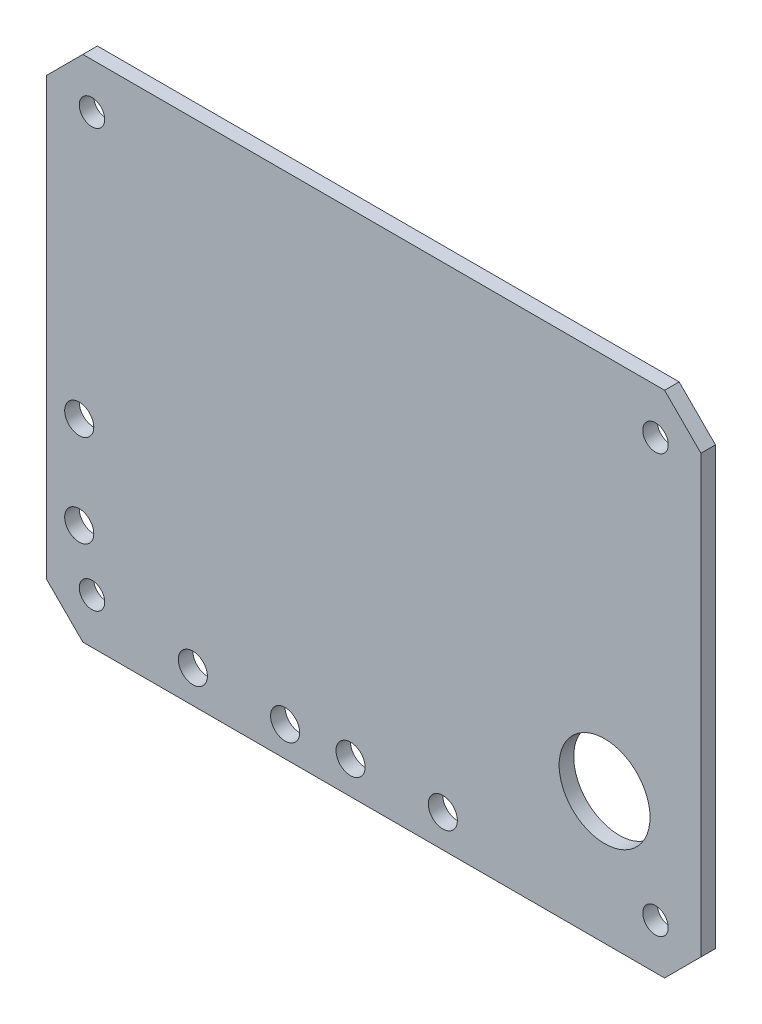
ISO-10303-21;
HEADER;
FILE_DESCRIPTION(('STEP AP214'),'2;1');
FILE_NAME('part.step','',(''),(''),'','','');
FILE_SCHEMA(('AUTOMOTIVE_DESIGN { 1 0 10303 214 1 1 1 1 }'));
ENDSEC;
DATA;
#1=APPLICATION_CONTEXT('core data for automotive mechanical design processes');
#2=APPLICATION_PROTOCOL_DEFINITION('international standard','automotive_design',2000,#1);
#3=PRODUCT_CONTEXT('',#1,'mechanical');
#4=PRODUCT('Part','Part','',(#3));
#5=PRODUCT_RELATED_PRODUCT_CATEGORY('part','',(#4));
#6=PRODUCT_DEFINITION_FORMATION('','',#4);
#7=PRODUCT_DEFINITION_CONTEXT('part definition',#1,'design');
#8=PRODUCT_DEFINITION('design','',#6,#7);
#9=PRODUCT_DEFINITION_SHAPE('','',#8);
#10=(LENGTH_UNIT() NAMED_UNIT(*) SI_UNIT(.MILLI.,.METRE.));
#11=(NAMED_UNIT(*) PLANE_ANGLE_UNIT() SI_UNIT($,.RADIAN.));
#12=(NAMED_UNIT(*) SI_UNIT($,.STERADIAN.) SOLID_ANGLE_UNIT());
#13=UNCERTAINTY_MEASURE_WITH_UNIT(LENGTH_MEASURE(1.E-05),#10,'distance_accuracy_value','');
#14=(GEOMETRIC_REPRESENTATION_CONTEXT(3) GLOBAL_UNCERTAINTY_ASSIGNED_CONTEXT((#13)) GLOBAL_UNIT_ASSIGNED_CONTEXT((#10,
#11,#12)) REPRESENTATION_CONTEXT('',''));
#15=CARTESIAN_POINT('',(0.,0.,0.));
#16=DIRECTION('',(0.,0.,1.));
#17=DIRECTION('',(1.,0.,0.));
#18=AXIS2_PLACEMENT_3D('',#15,#16,#17);
#19=CARTESIAN_POINT('',(32.,28.,1.6));
#20=DIRECTION('',(0.,-1.,0.));
#21=DIRECTION('',(1.,0.,0.));
#22=AXIS2_PLACEMENT_3D('',#19,#20,#21);
#23=PLANE('',#22);
#24=DIRECTION('',(-1.,0.,0.));
#25=VECTOR('',#24,1.);
#26=CARTESIAN_POINT('',(32.,28.,0.));
#27=LINE('',#26,#25);
#28=CARTESIAN_POINT('',(32.,28.,0.));
#29=VERTEX_POINT('',#28);
#30=CARTESIAN_POINT('',(-32.,28.,0.));
#31=VERTEX_POINT('',#30);
#32=EDGE_CURVE('E131',#29,#31,#27,.T.);
#33=ORIENTED_EDGE('',*,*,#32,.T.);
#34=DIRECTION('',(0.,0.,-1.));
#35=VECTOR('',#34,1.);
#36=CARTESIAN_POINT('',(-32.,28.,1.6));
#37=LINE('',#36,#35);
#38=CARTESIAN_POINT('',(-32.,28.,1.6));
#39=VERTEX_POINT('',#38);
#40=EDGE_CURVE('E11',#39,#31,#37,.T.);
#41=ORIENTED_EDGE('',*,*,#40,.F.);
#42=DIRECTION('',(-1.,0.,0.));
#43=VECTOR('',#42,1.);
#44=CARTESIAN_POINT('',(32.,28.,1.6));
#45=LINE('',#44,#43);
#46=CARTESIAN_POINT('',(32.,28.,1.6));
#47=VERTEX_POINT('',#46);
#48=EDGE_CURVE('E146',#47,#39,#45,.T.);
#49=ORIENTED_EDGE('',*,*,#48,.F.);
#50=DIRECTION('',(0.,0.,-1.));
#51=VECTOR('',#50,1.);
#52=CARTESIAN_POINT('',(32.,28.,1.6));
#53=LINE('',#52,#51);
#54=EDGE_CURVE('E127',#47,#29,#53,.T.);
#55=ORIENTED_EDGE('',*,*,#54,.T.);
#56=EDGE_LOOP('',(#33,#41,#49,#55));
#57=FACE_BOUND('',#56,.T.);
#58=ADVANCED_FACE('F33',(#57),#23,.F.);
#59=CARTESIAN_POINT('',(-36.,24.,1.6));
#60=DIRECTION('',(0.707106781186548,-0.707106781186547,0.));
#61=DIRECTION('',(0.707106781186547,0.707106781186548,0.));
#62=AXIS2_PLACEMENT_3D('',#59,#60,#61);
#63=PLANE('',#62);
#64=DIRECTION('',(-0.707106781186547,-0.707106781186548,0.));
#65=VECTOR('',#64,1.);
#66=CARTESIAN_POINT('',(-36.,24.,0.));
#67=LINE('',#66,#65);
#68=CARTESIAN_POINT('',(-36.,24.,0.));
#69=VERTEX_POINT('',#68);
#70=EDGE_CURVE('E134',#31,#69,#67,.T.);
#71=ORIENTED_EDGE('',*,*,#70,.T.);
#72=DIRECTION('',(0.,0.,-1.));
#73=VECTOR('',#72,1.);
#74=CARTESIAN_POINT('',(-36.,24.,1.6));
#75=LINE('',#74,#73);
#76=CARTESIAN_POINT('',(-36.,24.,1.6));
#77=VERTEX_POINT('',#76);
#78=EDGE_CURVE('E42',#77,#69,#75,.T.);
#79=ORIENTED_EDGE('',*,*,#78,.F.);
#80=DIRECTION('',(-0.707106781186547,-0.707106781186548,0.));
#81=VECTOR('',#80,1.);
#82=CARTESIAN_POINT('',(-36.,24.,1.6));
#83=LINE('',#82,#81);
#84=EDGE_CURVE('E94',#39,#77,#83,.T.);
#85=ORIENTED_EDGE('',*,*,#84,.F.);
#86=ORIENTED_EDGE('',*,*,#40,.T.);
#87=EDGE_LOOP('',(#71,#79,#85,#86));
#88=FACE_BOUND('',#87,.T.);
#89=ADVANCED_FACE('F245',(#88),#63,.F.);
#90=CARTESIAN_POINT('',(-36.,-24.,1.6));
#91=DIRECTION('',(1.,0.,0.));
#92=DIRECTION('',(0.,0.,-1.));
#93=AXIS2_PLACEMENT_3D('',#90,#91,#92);
#94=PLANE('',#93);
#95=DIRECTION('',(0.,-1.,0.));
#96=VECTOR('',#95,1.);
#97=CARTESIAN_POINT('',(-36.,-24.,0.));
#98=LINE('',#97,#96);
#99=CARTESIAN_POINT('',(-36.,-24.,0.));
#100=VERTEX_POINT('',#99);
#101=EDGE_CURVE('E137',#69,#100,#98,.T.);
#102=ORIENTED_EDGE('',*,*,#101,.T.);
#103=DIRECTION('',(0.,0.,-1.));
#104=VECTOR('',#103,1.);
#105=CARTESIAN_POINT('',(-36.,-24.,1.6));
#106=LINE('',#105,#104);
#107=CARTESIAN_POINT('',(-36.,-24.,1.6));
#108=VERTEX_POINT('',#107);
#109=EDGE_CURVE('E153',#108,#100,#106,.T.);
#110=ORIENTED_EDGE('',*,*,#109,.F.);
#111=DIRECTION('',(0.,-1.,0.));
#112=VECTOR('',#111,1.);
#113=CARTESIAN_POINT('',(-36.,-24.,1.6));
#114=LINE('',#113,#112);
#115=EDGE_CURVE('E212',#77,#108,#114,.T.);
#116=ORIENTED_EDGE('',*,*,#115,.F.);
#117=ORIENTED_EDGE('',*,*,#78,.T.);
#118=EDGE_LOOP('',(#102,#110,#116,#117));
#119=FACE_BOUND('',#118,.T.);
#120=ADVANCED_FACE('F249',(#119),#94,.F.);
#121=CARTESIAN_POINT('',(-36.,-24.,1.6));
#122=DIRECTION('',(0.707106781186548,0.707106781186547,0.));
#123=DIRECTION('',(-0.707106781186547,0.707106781186548,0.));
#124=AXIS2_PLACEMENT_3D('',#121,#122,#123);
#125=PLANE('',#124);
#126=DIRECTION('',(0.707106781186547,-0.707106781186548,0.));
#127=VECTOR('',#126,1.);
#128=CARTESIAN_POINT('',(-36.,-24.,0.));
#129=LINE('',#128,#127);
#130=CARTESIAN_POINT('',(-32.,-28.,0.));
#131=VERTEX_POINT('',#130);
#132=EDGE_CURVE('E139',#100,#131,#129,.T.);
#133=ORIENTED_EDGE('',*,*,#132,.T.);
#134=DIRECTION('',(0.,0.,-1.));
#135=VECTOR('',#134,1.);
#136=CARTESIAN_POINT('',(-32.,-28.,1.6));
#137=LINE('',#136,#135);
#138=CARTESIAN_POINT('',(-32.,-28.,1.6));
#139=VERTEX_POINT('',#138);
#140=EDGE_CURVE('E150',#139,#131,#137,.T.);
#141=ORIENTED_EDGE('',*,*,#140,.F.);
#142=DIRECTION('',(0.707106781186547,-0.707106781186548,0.));
#143=VECTOR('',#142,1.);
#144=CARTESIAN_POINT('',(-36.,-24.,1.6));
#145=LINE('',#144,#143);
#146=EDGE_CURVE('E214',#108,#139,#145,.T.);
#147=ORIENTED_EDGE('',*,*,#146,.F.);
#148=ORIENTED_EDGE('',*,*,#109,.T.);
#149=EDGE_LOOP('',(#133,#141,#147,#148));
#150=FACE_BOUND('',#149,.T.);
#151=ADVANCED_FACE('F220',(#150),#125,.F.);
#152=CARTESIAN_POINT('',(32.,-28.,1.6));
#153=DIRECTION('',(0.,1.,0.));
#154=DIRECTION('',(-1.,0.,0.));
#155=AXIS2_PLACEMENT_3D('',#152,#153,#154);
#156=PLANE('',#155);
#157=DIRECTION('',(1.,0.,0.));
#158=VECTOR('',#157,1.);
#159=CARTESIAN_POINT('',(32.,-28.,0.));
#160=LINE('',#159,#158);
#161=CARTESIAN_POINT('',(32.,-28.,0.));
#162=VERTEX_POINT('',#161);
#163=EDGE_CURVE('E141',#131,#162,#160,.T.);
#164=ORIENTED_EDGE('',*,*,#163,.T.);
#165=DIRECTION('',(0.,0.,-1.));
#166=VECTOR('',#165,1.);
#167=CARTESIAN_POINT('',(32.,-28.,1.6));
#168=LINE('',#167,#166);
#169=CARTESIAN_POINT('',(32.,-28.,1.6));
#170=VERTEX_POINT('',#169);
#171=EDGE_CURVE('E122',#170,#162,#168,.T.);
#172=ORIENTED_EDGE('',*,*,#171,.F.);
#173=DIRECTION('',(1.,0.,0.));
#174=VECTOR('',#173,1.);
#175=CARTESIAN_POINT('',(32.,-28.,1.6));
#176=LINE('',#175,#174);
#177=EDGE_CURVE('E113',#139,#170,#176,.T.);
#178=ORIENTED_EDGE('',*,*,#177,.F.);
#179=ORIENTED_EDGE('',*,*,#140,.T.);
#180=EDGE_LOOP('',(#164,#172,#178,#179));
#181=FACE_BOUND('',#180,.T.);
#182=ADVANCED_FACE('F224',(#181),#156,.F.);
#183=CARTESIAN_POINT('',(32.,-28.,1.6));
#184=DIRECTION('',(-0.707106781186548,0.707106781186547,0.));
#185=DIRECTION('',(-0.707106781186547,-0.707106781186548,0.));
#186=AXIS2_PLACEMENT_3D('',#183,#184,#185);
#187=PLANE('',#186);
#188=DIRECTION('',(0.707106781186547,0.707106781186548,0.));
#189=VECTOR('',#188,1.);
#190=CARTESIAN_POINT('',(32.,-28.,0.));
#191=LINE('',#190,#189);
#192=CARTESIAN_POINT('',(36.,-24.,0.));
#193=VERTEX_POINT('',#192);
#194=EDGE_CURVE('E121',#162,#193,#191,.T.);
#195=ORIENTED_EDGE('',*,*,#194,.T.);
#196=DIRECTION('',(0.,0.,-1.));
#197=VECTOR('',#196,1.);
#198=CARTESIAN_POINT('',(36.,-24.,1.6));
#199=LINE('',#198,#197);
#200=CARTESIAN_POINT('',(36.,-24.,1.6));
#201=VERTEX_POINT('',#200);
#202=EDGE_CURVE('E118',#201,#193,#199,.T.);
#203=ORIENTED_EDGE('',*,*,#202,.F.);
#204=DIRECTION('',(0.707106781186547,0.707106781186548,0.));
#205=VECTOR('',#204,1.);
#206=CARTESIAN_POINT('',(32.,-28.,1.6));
#207=LINE('',#206,#205);
#208=EDGE_CURVE('E107',#170,#201,#207,.T.);
#209=ORIENTED_EDGE('',*,*,#208,.F.);
#210=ORIENTED_EDGE('',*,*,#171,.T.);
#211=EDGE_LOOP('',(#195,#203,#209,#210));
#212=FACE_BOUND('',#211,.T.);
#213=ADVANCED_FACE('F119',(#212),#187,.F.);
#214=CARTESIAN_POINT('',(36.,-24.,1.6));
#215=DIRECTION('',(-1.,0.,0.));
#216=DIRECTION('',(0.,0.,1.));
#217=AXIS2_PLACEMENT_3D('',#214,#215,#216);
#218=PLANE('',#217);
#219=DIRECTION('',(0.,1.,0.));
#220=VECTOR('',#219,1.);
#221=CARTESIAN_POINT('',(36.,-24.,0.));
#222=LINE('',#221,#220);
#223=CARTESIAN_POINT('',(36.,24.,0.));
#224=VERTEX_POINT('',#223);
#225=EDGE_CURVE('E80',#193,#224,#222,.T.);
#226=ORIENTED_EDGE('',*,*,#225,.T.);
#227=DIRECTION('',(0.,0.,-1.));
#228=VECTOR('',#227,1.);
#229=CARTESIAN_POINT('',(36.,24.,1.6));
#230=LINE('',#229,#228);
#231=CARTESIAN_POINT('',(36.,24.,1.6));
#232=VERTEX_POINT('',#231);
#233=EDGE_CURVE('E123',#232,#224,#230,.T.);
#234=ORIENTED_EDGE('',*,*,#233,.F.);
#235=DIRECTION('',(0.,1.,0.));
#236=VECTOR('',#235,1.);
#237=CARTESIAN_POINT('',(36.,-24.,1.6));
#238=LINE('',#237,#236);
#239=EDGE_CURVE('E111',#201,#232,#238,.T.);
#240=ORIENTED_EDGE('',*,*,#239,.F.);
#241=ORIENTED_EDGE('',*,*,#202,.T.);
#242=EDGE_LOOP('',(#226,#234,#240,#241));
#243=FACE_BOUND('',#242,.T.);
#244=ADVANCED_FACE('F125',(#243),#218,.F.);
#245=CARTESIAN_POINT('',(32.,28.,1.6));
#246=DIRECTION('',(-0.707106781186548,-0.707106781186548,0.));
#247=DIRECTION('',(0.707106781186548,-0.707106781186548,0.));
#248=AXIS2_PLACEMENT_3D('',#245,#246,#247);
#249=PLANE('',#248);
#250=DIRECTION('',(-0.707106781186548,0.707106781186548,0.));
#251=VECTOR('',#250,1.);
#252=CARTESIAN_POINT('',(32.,28.,0.));
#253=LINE('',#252,#251);
#254=EDGE_CURVE('E86',#224,#29,#253,.T.);
#255=ORIENTED_EDGE('',*,*,#254,.T.);
#256=ORIENTED_EDGE('',*,*,#54,.F.);
#257=DIRECTION('',(-0.707106781186548,0.707106781186548,0.));
#258=VECTOR('',#257,1.);
#259=CARTESIAN_POINT('',(32.,28.,1.6));
#260=LINE('',#259,#258);
#261=EDGE_CURVE('E51',#232,#47,#260,.T.);
#262=ORIENTED_EDGE('',*,*,#261,.F.);
#263=ORIENTED_EDGE('',*,*,#233,.T.);
#264=EDGE_LOOP('',(#255,#256,#262,#263));
#265=FACE_BOUND('',#264,.T.);
#266=ADVANCED_FACE('F232',(#265),#249,.F.);
#267=CARTESIAN_POINT('',(0.,0.,1.6));
#268=DIRECTION('',(0.,0.,-1.));
#269=DIRECTION('',(-1.,0.,0.));
#270=AXIS2_PLACEMENT_3D('',#267,#268,#269);
#271=PLANE('',#270);
#272=CARTESIAN_POINT('',(-32.4,-6.92500000000001,1.6));
#273=DIRECTION('',(0.,0.,1.));
#274=DIRECTION('',(1.,0.,0.));
#275=AXIS2_PLACEMENT_3D('',#272,#273,#274);
#276=CIRCLE('',#275,1.6);
#277=CARTESIAN_POINT('',(-30.8,-6.92500000000001,1.6));
#278=VERTEX_POINT('',#277);
#279=EDGE_CURVE('E397',#278,#278,#276,.T.);
#280=ORIENTED_EDGE('',*,*,#279,.F.);
#281=EDGE_LOOP('',(#280));
#282=FACE_BOUND('',#281,.T.);
#283=CARTESIAN_POINT('',(-9.75,-24.6989065367995,1.6));
#284=DIRECTION('',(0.,0.,1.));
#285=DIRECTION('',(1.,0.,0.));
#286=AXIS2_PLACEMENT_3D('',#283,#284,#285);
#287=CIRCLE('',#286,1.6);
#288=CARTESIAN_POINT('',(-8.14999999999999,-24.6989065367995,1.6));
#289=VERTEX_POINT('',#288);
#290=EDGE_CURVE('E407',#289,#289,#287,.T.);
#291=ORIENTED_EDGE('',*,*,#290,.F.);
#292=EDGE_LOOP('',(#291));
#293=FACE_BOUND('',#292,.T.);
#294=CARTESIAN_POINT('',(-2.55,-24.4,1.6));
#295=DIRECTION('',(0.,0.,1.));
#296=DIRECTION('',(1.,0.,0.));
#297=AXIS2_PLACEMENT_3D('',#294,#295,#296);
#298=CIRCLE('',#297,1.6);
#299=CARTESIAN_POINT('',(-0.949999999999996,-24.4,1.6));
#300=VERTEX_POINT('',#299);
#301=EDGE_CURVE('E404',#300,#300,#298,.T.);
#302=ORIENTED_EDGE('',*,*,#301,.F.);
#303=EDGE_LOOP('',(#302));
#304=FACE_BOUND('',#303,.T.);
#305=CARTESIAN_POINT('',(7.6,-24.4,1.6));
#306=DIRECTION('',(0.,0.,1.));
#307=DIRECTION('',(1.,0.,0.));
#308=AXIS2_PLACEMENT_3D('',#305,#306,#307);
#309=CIRCLE('',#308,1.6);
#310=CARTESIAN_POINT('',(9.20000000000001,-24.4,1.6));
#311=VERTEX_POINT('',#310);
#312=EDGE_CURVE('E401',#311,#311,#309,.T.);
#313=ORIENTED_EDGE('',*,*,#312,.F.);
#314=EDGE_LOOP('',(#313));
#315=FACE_BOUND('',#314,.T.);
#316=CARTESIAN_POINT('',(-32.4,-17.075,1.6));
#317=DIRECTION('',(0.,0.,1.));
#318=DIRECTION('',(1.,0.,0.));
#319=AXIS2_PLACEMENT_3D('',#316,#317,#318);
#320=CIRCLE('',#319,1.6);
#321=CARTESIAN_POINT('',(-30.8,-17.075,1.6));
#322=VERTEX_POINT('',#321);
#323=EDGE_CURVE('E398',#322,#322,#320,.T.);
#324=ORIENTED_EDGE('',*,*,#323,.F.);
#325=EDGE_LOOP('',(#324));
#326=FACE_BOUND('',#325,.T.);
#327=CARTESIAN_POINT('',(-19.9,-24.4,1.6));
#328=DIRECTION('',(0.,0.,1.));
#329=DIRECTION('',(1.,0.,0.));
#330=AXIS2_PLACEMENT_3D('',#327,#328,#329);
#331=CIRCLE('',#330,1.6);
#332=CARTESIAN_POINT('',(-18.3,-24.4,1.6));
#333=VERTEX_POINT('',#332);
#334=EDGE_CURVE('E162',#333,#333,#331,.T.);
#335=ORIENTED_EDGE('',*,*,#334,.F.);
#336=EDGE_LOOP('',(#335));
#337=FACE_BOUND('',#336,.T.);
#338=CARTESIAN_POINT('',(25.4,-13.5,1.6));
#339=DIRECTION('',(0.,0.,1.));
#340=DIRECTION('',(1.,0.,0.));
#341=AXIS2_PLACEMENT_3D('',#338,#339,#340);
#342=CIRCLE('',#341,5.);
#343=CARTESIAN_POINT('',(30.4,-13.5,1.6));
#344=VERTEX_POINT('',#343);
#345=EDGE_CURVE('E175',#344,#344,#342,.T.);
#346=ORIENTED_EDGE('',*,*,#345,.F.);
#347=EDGE_LOOP('',(#346));
#348=FACE_BOUND('',#347,.T.);
#349=CARTESIAN_POINT('',(31.,23.,1.6));
#350=DIRECTION('',(0.,0.,1.));
#351=DIRECTION('',(1.,0.,0.));
#352=AXIS2_PLACEMENT_3D('',#349,#350,#351);
#353=CIRCLE('',#352,1.39999999999999);
#354=CARTESIAN_POINT('',(32.4,23.,1.6));
#355=VERTEX_POINT('',#354);
#356=EDGE_CURVE('E198',#355,#355,#353,.T.);
#357=ORIENTED_EDGE('',*,*,#356,.F.);
#358=EDGE_LOOP('',(#357));
#359=FACE_BOUND('',#358,.T.);
#360=CARTESIAN_POINT('',(-31.,-23.,1.6));
#361=DIRECTION('',(0.,0.,1.));
#362=DIRECTION('',(1.,0.,0.));
#363=AXIS2_PLACEMENT_3D('',#360,#361,#362);
#364=CIRCLE('',#363,1.4);
#365=CARTESIAN_POINT('',(-29.6,-23.,1.6));
#366=VERTEX_POINT('',#365);
#367=EDGE_CURVE('E191',#366,#366,#364,.T.);
#368=ORIENTED_EDGE('',*,*,#367,.F.);
#369=EDGE_LOOP('',(#368));
#370=FACE_BOUND('',#369,.T.);
#371=CARTESIAN_POINT('',(31.,-23.,1.6));
#372=DIRECTION('',(0.,0.,1.));
#373=DIRECTION('',(1.,0.,0.));
#374=AXIS2_PLACEMENT_3D('',#371,#372,#373);
#375=CIRCLE('',#374,1.4);
#376=CARTESIAN_POINT('',(32.4,-23.,1.6));
#377=VERTEX_POINT('',#376);
#378=EDGE_CURVE('E184',#377,#377,#375,.T.);
#379=ORIENTED_EDGE('',*,*,#378,.F.);
#380=EDGE_LOOP('',(#379));
#381=FACE_BOUND('',#380,.T.);
#382=CARTESIAN_POINT('',(-31.,23.,1.6));
#383=DIRECTION('',(0.,0.,1.));
#384=DIRECTION('',(1.,0.,0.));
#385=AXIS2_PLACEMENT_3D('',#382,#383,#384);
#386=CIRCLE('',#385,1.4);
#387=CARTESIAN_POINT('',(-29.6,23.,1.6));
#388=VERTEX_POINT('',#387);
#389=EDGE_CURVE('E197',#388,#388,#386,.T.);
#390=ORIENTED_EDGE('',*,*,#389,.F.);
#391=EDGE_LOOP('',(#390));
#392=FACE_BOUND('',#391,.T.);
#393=ORIENTED_EDGE('',*,*,#48,.T.);
#394=ORIENTED_EDGE('',*,*,#84,.T.);
#395=ORIENTED_EDGE('',*,*,#115,.T.);
#396=ORIENTED_EDGE('',*,*,#146,.T.);
#397=ORIENTED_EDGE('',*,*,#177,.T.);
#398=ORIENTED_EDGE('',*,*,#208,.T.);
#399=ORIENTED_EDGE('',*,*,#239,.T.);
#400=ORIENTED_EDGE('',*,*,#261,.T.);
#401=EDGE_LOOP('',(#393,#394,#395,#396,#397,#398,#399,#400));
#402=FACE_BOUND('',#401,.T.);
#403=ADVANCED_FACE('F109',(#282,#293,#304,#315,#326,#337,#348,#359,#370,#381,#392,#402),#271,.F.);
#404=CARTESIAN_POINT('',(0.,0.,0.));
#405=DIRECTION('',(0.,0.,-1.));
#406=DIRECTION('',(-1.,0.,0.));
#407=AXIS2_PLACEMENT_3D('',#404,#405,#406);
#408=PLANE('',#407);
#409=CARTESIAN_POINT('',(-32.4,-6.92500000000001,0.));
#410=DIRECTION('',(0.,0.,-1.));
#411=DIRECTION('',(-1.,0.,0.));
#412=AXIS2_PLACEMENT_3D('',#409,#410,#411);
#413=CIRCLE('',#412,1.6);
#414=CARTESIAN_POINT('',(-34.,-6.92500000000001,0.));
#415=VERTEX_POINT('',#414);
#416=EDGE_CURVE('E36',#415,#415,#413,.T.);
#417=ORIENTED_EDGE('',*,*,#416,.F.);
#418=EDGE_LOOP('',(#417));
#419=FACE_BOUND('',#418,.T.);
#420=CARTESIAN_POINT('',(-9.75,-24.6989065367995,0.));
#421=DIRECTION('',(0.,0.,-1.));
#422=DIRECTION('',(-1.,0.,0.));
#423=AXIS2_PLACEMENT_3D('',#420,#421,#422);
#424=CIRCLE('',#423,1.6);
#425=CARTESIAN_POINT('',(-11.35,-24.6989065367995,0.));
#426=VERTEX_POINT('',#425);
#427=EDGE_CURVE('E170',#426,#426,#424,.T.);
#428=ORIENTED_EDGE('',*,*,#427,.F.);
#429=EDGE_LOOP('',(#428));
#430=FACE_BOUND('',#429,.T.);
#431=CARTESIAN_POINT('',(-2.55,-24.4,0.));
#432=DIRECTION('',(0.,0.,-1.));
#433=DIRECTION('',(-1.,0.,0.));
#434=AXIS2_PLACEMENT_3D('',#431,#432,#433);
#435=CIRCLE('',#434,1.6);
#436=CARTESIAN_POINT('',(-4.15,-24.4,0.));
#437=VERTEX_POINT('',#436);
#438=EDGE_CURVE('E168',#437,#437,#435,.T.);
#439=ORIENTED_EDGE('',*,*,#438,.F.);
#440=EDGE_LOOP('',(#439));
#441=FACE_BOUND('',#440,.T.);
#442=CARTESIAN_POINT('',(7.6,-24.4,0.));
#443=DIRECTION('',(0.,0.,-1.));
#444=DIRECTION('',(-1.,0.,0.));
#445=AXIS2_PLACEMENT_3D('',#442,#443,#444);
#446=CIRCLE('',#445,1.6);
#447=CARTESIAN_POINT('',(6.,-24.4,0.));
#448=VERTEX_POINT('',#447);
#449=EDGE_CURVE('E165',#448,#448,#446,.T.);
#450=ORIENTED_EDGE('',*,*,#449,.F.);
#451=EDGE_LOOP('',(#450));
#452=FACE_BOUND('',#451,.T.);
#453=CARTESIAN_POINT('',(-32.4,-17.075,0.));
#454=DIRECTION('',(0.,0.,-1.));
#455=DIRECTION('',(-1.,0.,0.));
#456=AXIS2_PLACEMENT_3D('',#453,#454,#455);
#457=CIRCLE('',#456,1.6);
#458=CARTESIAN_POINT('',(-34.,-17.075,0.));
#459=VERTEX_POINT('',#458);
#460=EDGE_CURVE('E161',#459,#459,#457,.T.);
#461=ORIENTED_EDGE('',*,*,#460,.F.);
#462=EDGE_LOOP('',(#461));
#463=FACE_BOUND('',#462,.T.);
#464=CARTESIAN_POINT('',(-19.9,-24.4,0.));
#465=DIRECTION('',(0.,0.,-1.));
#466=DIRECTION('',(-1.,0.,0.));
#467=AXIS2_PLACEMENT_3D('',#464,#465,#466);
#468=CIRCLE('',#467,1.6);
#469=CARTESIAN_POINT('',(-21.5,-24.4,0.));
#470=VERTEX_POINT('',#469);
#471=EDGE_CURVE('E158',#470,#470,#468,.T.);
#472=ORIENTED_EDGE('',*,*,#471,.F.);
#473=EDGE_LOOP('',(#472));
#474=FACE_BOUND('',#473,.T.);
#475=CARTESIAN_POINT('',(25.4,-13.5,0.));
#476=DIRECTION('',(0.,0.,1.));
#477=DIRECTION('',(1.,0.,0.));
#478=AXIS2_PLACEMENT_3D('',#475,#476,#477);
#479=CIRCLE('',#478,5.);
#480=CARTESIAN_POINT('',(30.4,-13.5,0.));
#481=VERTEX_POINT('',#480);
#482=EDGE_CURVE('E179',#481,#481,#479,.T.);
#483=ORIENTED_EDGE('',*,*,#482,.T.);
#484=EDGE_LOOP('',(#483));
#485=FACE_BOUND('',#484,.T.);
#486=CARTESIAN_POINT('',(31.,23.,0.));
#487=DIRECTION('',(0.,0.,1.));
#488=DIRECTION('',(1.,0.,0.));
#489=AXIS2_PLACEMENT_3D('',#486,#487,#488);
#490=CIRCLE('',#489,1.39999999999999);
#491=CARTESIAN_POINT('',(32.4,23.,0.));
#492=VERTEX_POINT('',#491);
#493=EDGE_CURVE('E194',#492,#492,#490,.T.);
#494=ORIENTED_EDGE('',*,*,#493,.T.);
#495=EDGE_LOOP('',(#494));
#496=FACE_BOUND('',#495,.T.);
#497=CARTESIAN_POINT('',(-31.,-23.,0.));
#498=DIRECTION('',(0.,0.,1.));
#499=DIRECTION('',(1.,0.,0.));
#500=AXIS2_PLACEMENT_3D('',#497,#498,#499);
#501=CIRCLE('',#500,1.4);
#502=CARTESIAN_POINT('',(-29.6,-23.,0.));
#503=VERTEX_POINT('',#502);
#504=EDGE_CURVE('E201',#503,#503,#501,.T.);
#505=ORIENTED_EDGE('',*,*,#504,.T.);
#506=EDGE_LOOP('',(#505));
#507=FACE_BOUND('',#506,.T.);
#508=CARTESIAN_POINT('',(31.,-23.,0.));
#509=DIRECTION('',(0.,0.,1.));
#510=DIRECTION('',(1.,0.,0.));
#511=AXIS2_PLACEMENT_3D('',#508,#509,#510);
#512=CIRCLE('',#511,1.4);
#513=CARTESIAN_POINT('',(32.4,-23.,0.));
#514=VERTEX_POINT('',#513);
#515=EDGE_CURVE('E188',#514,#514,#512,.T.);
#516=ORIENTED_EDGE('',*,*,#515,.T.);
#517=EDGE_LOOP('',(#516));
#518=FACE_BOUND('',#517,.T.);
#519=CARTESIAN_POINT('',(-31.,23.,0.));
#520=DIRECTION('',(0.,0.,1.));
#521=DIRECTION('',(1.,0.,0.));
#522=AXIS2_PLACEMENT_3D('',#519,#520,#521);
#523=CIRCLE('',#522,1.4);
#524=CARTESIAN_POINT('',(-29.6,23.,0.));
#525=VERTEX_POINT('',#524);
#526=EDGE_CURVE('E135',#525,#525,#523,.T.);
#527=ORIENTED_EDGE('',*,*,#526,.T.);
#528=EDGE_LOOP('',(#527));
#529=FACE_BOUND('',#528,.T.);
#530=ORIENTED_EDGE('',*,*,#32,.F.);
#531=ORIENTED_EDGE('',*,*,#254,.F.);
#532=ORIENTED_EDGE('',*,*,#225,.F.);
#533=ORIENTED_EDGE('',*,*,#194,.F.);
#534=ORIENTED_EDGE('',*,*,#163,.F.);
#535=ORIENTED_EDGE('',*,*,#132,.F.);
#536=ORIENTED_EDGE('',*,*,#101,.F.);
#537=ORIENTED_EDGE('',*,*,#70,.F.);
#538=EDGE_LOOP('',(#530,#531,#532,#533,#534,#535,#536,#537));
#539=FACE_BOUND('',#538,.T.);
#540=ADVANCED_FACE('F227',(#419,#430,#441,#452,#463,#474,#485,#496,#507,#518,#529,#539),#408,.T.);
#541=CARTESIAN_POINT('',(-31.,23.,0.));
#542=DIRECTION('',(0.,0.,1.));
#543=DIRECTION('',(1.,0.,0.));
#544=AXIS2_PLACEMENT_3D('',#541,#542,#543);
#545=CYLINDRICAL_SURFACE('',#544,1.4);
#546=ORIENTED_EDGE('',*,*,#526,.F.);
#547=EDGE_LOOP('',(#546));
#548=FACE_BOUND('',#547,.T.);
#549=ORIENTED_EDGE('',*,*,#389,.T.);
#550=EDGE_LOOP('',(#549));
#551=FACE_BOUND('',#550,.T.);
#552=ADVANCED_FACE('F279',(#548,#551),#545,.F.);
#553=CARTESIAN_POINT('',(31.,-23.,0.));
#554=DIRECTION('',(0.,0.,1.));
#555=DIRECTION('',(1.,0.,0.));
#556=AXIS2_PLACEMENT_3D('',#553,#554,#555);
#557=CYLINDRICAL_SURFACE('',#556,1.4);
#558=ORIENTED_EDGE('',*,*,#515,.F.);
#559=EDGE_LOOP('',(#558));
#560=FACE_BOUND('',#559,.T.);
#561=ORIENTED_EDGE('',*,*,#378,.T.);
#562=EDGE_LOOP('',(#561));
#563=FACE_BOUND('',#562,.T.);
#564=ADVANCED_FACE('F284',(#560,#563),#557,.F.);
#565=CARTESIAN_POINT('',(-31.,-23.,0.));
#566=DIRECTION('',(0.,0.,1.));
#567=DIRECTION('',(1.,0.,0.));
#568=AXIS2_PLACEMENT_3D('',#565,#566,#567);
#569=CYLINDRICAL_SURFACE('',#568,1.4);
#570=ORIENTED_EDGE('',*,*,#504,.F.);
#571=EDGE_LOOP('',(#570));
#572=FACE_BOUND('',#571,.T.);
#573=ORIENTED_EDGE('',*,*,#367,.T.);
#574=EDGE_LOOP('',(#573));
#575=FACE_BOUND('',#574,.T.);
#576=ADVANCED_FACE('F296',(#572,#575),#569,.F.);
#577=CARTESIAN_POINT('',(31.,23.,0.));
#578=DIRECTION('',(0.,0.,1.));
#579=DIRECTION('',(1.,0.,0.));
#580=AXIS2_PLACEMENT_3D('',#577,#578,#579);
#581=CYLINDRICAL_SURFACE('',#580,1.39999999999999);
#582=ORIENTED_EDGE('',*,*,#493,.F.);
#583=EDGE_LOOP('',(#582));
#584=FACE_BOUND('',#583,.T.);
#585=ORIENTED_EDGE('',*,*,#356,.T.);
#586=EDGE_LOOP('',(#585));
#587=FACE_BOUND('',#586,.T.);
#588=ADVANCED_FACE('F306',(#584,#587),#581,.F.);
#589=CARTESIAN_POINT('',(25.4,-13.5,0.));
#590=DIRECTION('',(0.,0.,1.));
#591=DIRECTION('',(1.,0.,0.));
#592=AXIS2_PLACEMENT_3D('',#589,#590,#591);
#593=CYLINDRICAL_SURFACE('',#592,5.);
#594=ORIENTED_EDGE('',*,*,#482,.F.);
#595=EDGE_LOOP('',(#594));
#596=FACE_BOUND('',#595,.T.);
#597=ORIENTED_EDGE('',*,*,#345,.T.);
#598=EDGE_LOOP('',(#597));
#599=FACE_BOUND('',#598,.T.);
#600=ADVANCED_FACE('F316',(#596,#599),#593,.F.);
#601=CARTESIAN_POINT('',(-19.9,-24.4,-8.4));
#602=DIRECTION('',(0.,0.,1.));
#603=DIRECTION('',(1.,0.,0.));
#604=AXIS2_PLACEMENT_3D('',#601,#602,#603);
#605=CYLINDRICAL_SURFACE('',#604,1.6);
#606=ORIENTED_EDGE('',*,*,#471,.T.);
#607=EDGE_LOOP('',(#606));
#608=FACE_BOUND('',#607,.T.);
#609=ORIENTED_EDGE('',*,*,#334,.T.);
#610=EDGE_LOOP('',(#609));
#611=FACE_BOUND('',#610,.T.);
#612=ADVANCED_FACE('F325',(#608,#611),#605,.F.);
#613=CARTESIAN_POINT('',(-32.4,-17.075,-8.4));
#614=DIRECTION('',(0.,0.,1.));
#615=DIRECTION('',(1.,0.,0.));
#616=AXIS2_PLACEMENT_3D('',#613,#614,#615);
#617=CYLINDRICAL_SURFACE('',#616,1.6);
#618=ORIENTED_EDGE('',*,*,#460,.T.);
#619=EDGE_LOOP('',(#618));
#620=FACE_BOUND('',#619,.T.);
#621=ORIENTED_EDGE('',*,*,#323,.T.);
#622=EDGE_LOOP('',(#621));
#623=FACE_BOUND('',#622,.T.);
#624=ADVANCED_FACE('F342',(#620,#623),#617,.F.);
#625=CARTESIAN_POINT('',(7.6,-24.4,-8.4));
#626=DIRECTION('',(0.,0.,1.));
#627=DIRECTION('',(1.,0.,0.));
#628=AXIS2_PLACEMENT_3D('',#625,#626,#627);
#629=CYLINDRICAL_SURFACE('',#628,1.6);
#630=ORIENTED_EDGE('',*,*,#449,.T.);
#631=EDGE_LOOP('',(#630));
#632=FACE_BOUND('',#631,.T.);
#633=ORIENTED_EDGE('',*,*,#312,.T.);
#634=EDGE_LOOP('',(#633));
#635=FACE_BOUND('',#634,.T.);
#636=ADVANCED_FACE('F352',(#632,#635),#629,.F.);
#637=CARTESIAN_POINT('',(-2.55,-24.4,-8.4));
#638=DIRECTION('',(0.,0.,1.));
#639=DIRECTION('',(1.,0.,0.));
#640=AXIS2_PLACEMENT_3D('',#637,#638,#639);
#641=CYLINDRICAL_SURFACE('',#640,1.6);
#642=ORIENTED_EDGE('',*,*,#438,.T.);
#643=EDGE_LOOP('',(#642));
#644=FACE_BOUND('',#643,.T.);
#645=ORIENTED_EDGE('',*,*,#301,.T.);
#646=EDGE_LOOP('',(#645));
#647=FACE_BOUND('',#646,.T.);
#648=ADVANCED_FACE('F362',(#644,#647),#641,.F.);
#649=CARTESIAN_POINT('',(-9.75,-24.6989065367995,-8.4));
#650=DIRECTION('',(0.,0.,1.));
#651=DIRECTION('',(1.,0.,0.));
#652=AXIS2_PLACEMENT_3D('',#649,#650,#651);
#653=CYLINDRICAL_SURFACE('',#652,1.6);
#654=ORIENTED_EDGE('',*,*,#427,.T.);
#655=EDGE_LOOP('',(#654));
#656=FACE_BOUND('',#655,.T.);
#657=ORIENTED_EDGE('',*,*,#290,.T.);
#658=EDGE_LOOP('',(#657));
#659=FACE_BOUND('',#658,.T.);
#660=ADVANCED_FACE('F372',(#656,#659),#653,.F.);
#661=CARTESIAN_POINT('',(-32.4,-6.92500000000001,-8.4));
#662=DIRECTION('',(0.,0.,1.));
#663=DIRECTION('',(1.,0.,0.));
#664=AXIS2_PLACEMENT_3D('',#661,#662,#663);
#665=CYLINDRICAL_SURFACE('',#664,1.6);
#666=ORIENTED_EDGE('',*,*,#416,.T.);
#667=EDGE_LOOP('',(#666));
#668=FACE_BOUND('',#667,.T.);
#669=ORIENTED_EDGE('',*,*,#279,.T.);
#670=EDGE_LOOP('',(#669));
#671=FACE_BOUND('',#670,.T.);
#672=ADVANCED_FACE('F382',(#668,#671),#665,.F.);
#673=CLOSED_SHELL('',(#58,#89,#120,#151,#182,#213,#244,#266,#403,#540,#552,#564,#576,#588,#600,
#612,#624,#636,#648,#660,#672));
#674=MANIFOLD_SOLID_BREP('B2',#673);
#675=ADVANCED_BREP_SHAPE_REPRESENTATION('',(#18,#674),#14);
#676=SHAPE_DEFINITION_REPRESENTATION(#9,#675);
ENDSEC;
END-ISO-10303-21;
